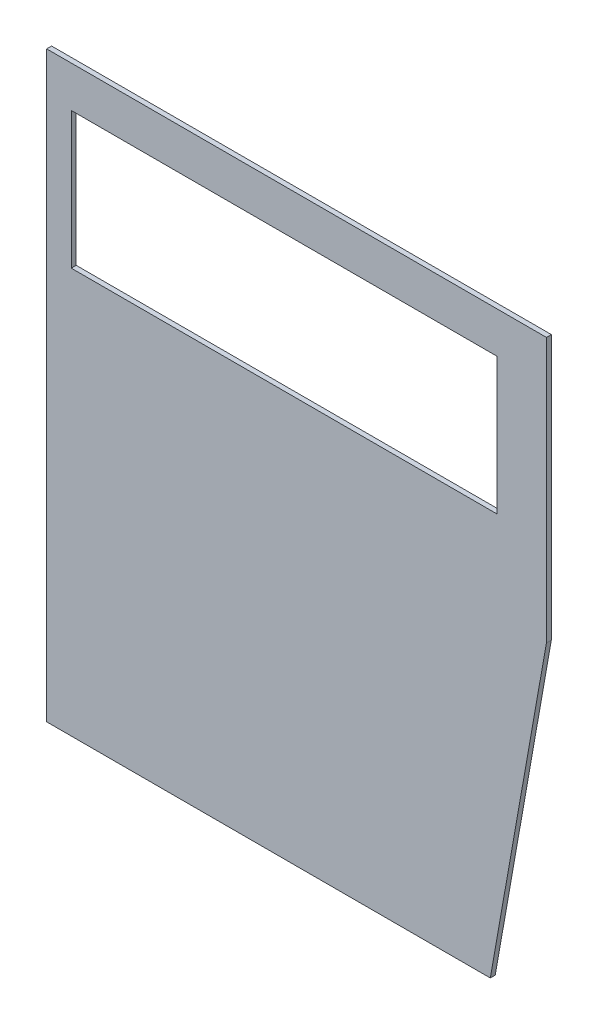
ISO-10303-21;
HEADER;
FILE_DESCRIPTION(('STEP AP214'),'2;1');
FILE_NAME('part.step','',(''),(''),'','','');
FILE_SCHEMA(('AUTOMOTIVE_DESIGN { 1 0 10303 214 1 1 1 1 }'));
ENDSEC;
DATA;
#1=APPLICATION_CONTEXT('core data for automotive mechanical design processes');
#2=APPLICATION_PROTOCOL_DEFINITION('international standard','automotive_design',2000,#1);
#3=PRODUCT_CONTEXT('',#1,'mechanical');
#4=PRODUCT('Part','Part','',(#3));
#5=PRODUCT_RELATED_PRODUCT_CATEGORY('part','',(#4));
#6=PRODUCT_DEFINITION_FORMATION('','',#4);
#7=PRODUCT_DEFINITION_CONTEXT('part definition',#1,'design');
#8=PRODUCT_DEFINITION('design','',#6,#7);
#9=PRODUCT_DEFINITION_SHAPE('','',#8);
#10=(LENGTH_UNIT() NAMED_UNIT(*) SI_UNIT(.MILLI.,.METRE.));
#11=(NAMED_UNIT(*) PLANE_ANGLE_UNIT() SI_UNIT($,.RADIAN.));
#12=(NAMED_UNIT(*) SI_UNIT($,.STERADIAN.) SOLID_ANGLE_UNIT());
#13=UNCERTAINTY_MEASURE_WITH_UNIT(LENGTH_MEASURE(1.E-05),#10,'distance_accuracy_value','');
#14=(GEOMETRIC_REPRESENTATION_CONTEXT(3) GLOBAL_UNCERTAINTY_ASSIGNED_CONTEXT((#13)) GLOBAL_UNIT_ASSIGNED_CONTEXT((#10,
#11,#12)) REPRESENTATION_CONTEXT('',''));
#15=CARTESIAN_POINT('',(0.,0.,0.));
#16=DIRECTION('',(0.,0.,1.));
#17=DIRECTION('',(1.,0.,0.));
#18=AXIS2_PLACEMENT_3D('',#15,#16,#17);
#19=CARTESIAN_POINT('',(816.176734530374,385.,-3.));
#20=DIRECTION('',(-1.,0.,0.));
#21=DIRECTION('',(0.,0.,1.));
#22=AXIS2_PLACEMENT_3D('',#19,#20,#21);
#23=PLANE('',#22);
#24=DIRECTION('',(0.,-1.,0.));
#25=VECTOR('',#24,1.);
#26=CARTESIAN_POINT('',(816.176734530374,385.,0.));
#27=LINE('',#26,#25);
#28=CARTESIAN_POINT('',(816.176734530374,385.,0.));
#29=VERTEX_POINT('',#28);
#30=CARTESIAN_POINT('',(816.176734530374,30.,0.));
#31=VERTEX_POINT('',#30);
#32=EDGE_CURVE('E138',#29,#31,#27,.T.);
#33=ORIENTED_EDGE('',*,*,#32,.F.);
#34=DIRECTION('',(0.,0.,1.));
#35=VECTOR('',#34,1.);
#36=CARTESIAN_POINT('',(816.176734530374,385.,-3.));
#37=LINE('',#36,#35);
#38=CARTESIAN_POINT('',(816.176734530374,385.,-3.));
#39=VERTEX_POINT('',#38);
#40=EDGE_CURVE('E11',#39,#29,#37,.T.);
#41=ORIENTED_EDGE('',*,*,#40,.F.);
#42=DIRECTION('',(0.,-1.,0.));
#43=VECTOR('',#42,1.);
#44=CARTESIAN_POINT('',(816.176734530374,385.,-3.));
#45=LINE('',#44,#43);
#46=CARTESIAN_POINT('',(816.176734530374,30.,-3.));
#47=VERTEX_POINT('',#46);
#48=EDGE_CURVE('E142',#39,#47,#45,.T.);
#49=ORIENTED_EDGE('',*,*,#48,.T.);
#50=DIRECTION('',(0.,0.,1.));
#51=VECTOR('',#50,1.);
#52=CARTESIAN_POINT('',(816.176734530374,30.,-3.));
#53=LINE('',#52,#51);
#54=EDGE_CURVE('E37',#47,#31,#53,.T.);
#55=ORIENTED_EDGE('',*,*,#54,.T.);
#56=EDGE_LOOP('',(#33,#41,#49,#55));
#57=FACE_BOUND('',#56,.T.);
#58=ADVANCED_FACE('F34',(#57),#23,.T.);
#59=CARTESIAN_POINT('',(1120.5748213672,385.,-3.));
#60=DIRECTION('',(0.,1.,0.));
#61=DIRECTION('',(-1.,0.,0.));
#62=AXIS2_PLACEMENT_3D('',#59,#60,#61);
#63=PLANE('',#62);
#64=DIRECTION('',(-1.,0.,0.));
#65=VECTOR('',#64,1.);
#66=CARTESIAN_POINT('',(1120.5748213672,385.,0.));
#67=LINE('',#66,#65);
#68=CARTESIAN_POINT('',(1120.5748213672,385.,0.));
#69=VERTEX_POINT('',#68);
#70=EDGE_CURVE('E146',#69,#29,#67,.T.);
#71=ORIENTED_EDGE('',*,*,#70,.F.);
#72=DIRECTION('',(0.,0.,1.));
#73=VECTOR('',#72,1.);
#74=CARTESIAN_POINT('',(1120.5748213672,385.,-3.));
#75=LINE('',#74,#73);
#76=CARTESIAN_POINT('',(1120.5748213672,385.,-3.));
#77=VERTEX_POINT('',#76);
#78=EDGE_CURVE('E42',#77,#69,#75,.T.);
#79=ORIENTED_EDGE('',*,*,#78,.F.);
#80=DIRECTION('',(-1.,0.,0.));
#81=VECTOR('',#80,1.);
#82=CARTESIAN_POINT('',(1120.5748213672,385.,-3.));
#83=LINE('',#82,#81);
#84=EDGE_CURVE('E155',#77,#39,#83,.T.);
#85=ORIENTED_EDGE('',*,*,#84,.T.);
#86=ORIENTED_EDGE('',*,*,#40,.T.);
#87=EDGE_LOOP('',(#71,#79,#85,#86));
#88=FACE_BOUND('',#87,.T.);
#89=ADVANCED_FACE('F187',(#88),#63,.T.);
#90=CARTESIAN_POINT('',(1120.5748213672,223.843941841835,-3.));
#91=DIRECTION('',(1.,0.,0.));
#92=DIRECTION('',(0.,1.,0.));
#93=AXIS2_PLACEMENT_3D('',#90,#91,#92);
#94=PLANE('',#93);
#95=DIRECTION('',(0.,1.,0.));
#96=VECTOR('',#95,1.);
#97=CARTESIAN_POINT('',(1120.5748213672,223.843941841835,0.));
#98=LINE('',#97,#96);
#99=CARTESIAN_POINT('',(1120.5748213672,223.843941841835,0.));
#100=VERTEX_POINT('',#99);
#101=EDGE_CURVE('E166',#100,#69,#98,.T.);
#102=ORIENTED_EDGE('',*,*,#101,.F.);
#103=DIRECTION('',(0.,0.,1.));
#104=VECTOR('',#103,1.);
#105=CARTESIAN_POINT('',(1120.5748213672,223.843941841835,-3.));
#106=LINE('',#105,#104);
#107=CARTESIAN_POINT('',(1120.5748213672,223.843941841835,-3.));
#108=VERTEX_POINT('',#107);
#109=EDGE_CURVE('E172',#108,#100,#106,.T.);
#110=ORIENTED_EDGE('',*,*,#109,.F.);
#111=DIRECTION('',(0.,1.,0.));
#112=VECTOR('',#111,1.);
#113=CARTESIAN_POINT('',(1120.5748213672,223.843941841835,-3.));
#114=LINE('',#113,#112);
#115=EDGE_CURVE('E152',#108,#77,#114,.T.);
#116=ORIENTED_EDGE('',*,*,#115,.T.);
#117=ORIENTED_EDGE('',*,*,#78,.T.);
#118=EDGE_LOOP('',(#102,#110,#116,#117));
#119=FACE_BOUND('',#118,.T.);
#120=ADVANCED_FACE('F194',(#119),#94,.T.);
#121=CARTESIAN_POINT('',(1086.39490437361,30.,-3.));
#122=DIRECTION('',(0.984807753012209,-0.173648177666926,0.));
#123=DIRECTION('',(0.173648177666926,0.984807753012209,0.));
#124=AXIS2_PLACEMENT_3D('',#121,#122,#123);
#125=PLANE('',#124);
#126=DIRECTION('',(0.173648177666926,0.984807753012209,0.));
#127=VECTOR('',#126,1.);
#128=CARTESIAN_POINT('',(1086.39490437361,30.,0.));
#129=LINE('',#128,#127);
#130=CARTESIAN_POINT('',(1086.39490437361,30.,0.));
#131=VERTEX_POINT('',#130);
#132=EDGE_CURVE('E163',#131,#100,#129,.T.);
#133=ORIENTED_EDGE('',*,*,#132,.F.);
#134=DIRECTION('',(0.,0.,1.));
#135=VECTOR('',#134,1.);
#136=CARTESIAN_POINT('',(1086.39490437361,30.,-3.));
#137=LINE('',#136,#135);
#138=CARTESIAN_POINT('',(1086.39490437361,30.,-3.));
#139=VERTEX_POINT('',#138);
#140=EDGE_CURVE('E173',#139,#131,#137,.T.);
#141=ORIENTED_EDGE('',*,*,#140,.F.);
#142=DIRECTION('',(0.173648177666926,0.984807753012209,0.));
#143=VECTOR('',#142,1.);
#144=CARTESIAN_POINT('',(1086.39490437361,30.,-3.));
#145=LINE('',#144,#143);
#146=EDGE_CURVE('E149',#139,#108,#145,.T.);
#147=ORIENTED_EDGE('',*,*,#146,.T.);
#148=ORIENTED_EDGE('',*,*,#109,.T.);
#149=EDGE_LOOP('',(#133,#141,#147,#148));
#150=FACE_BOUND('',#149,.T.);
#151=ADVANCED_FACE('F192',(#150),#125,.T.);
#152=CARTESIAN_POINT('',(816.176734530374,30.,-3.));
#153=DIRECTION('',(0.,-1.,0.));
#154=DIRECTION('',(0.,0.,-1.));
#155=AXIS2_PLACEMENT_3D('',#152,#153,#154);
#156=PLANE('',#155);
#157=DIRECTION('',(1.,0.,0.));
#158=VECTOR('',#157,1.);
#159=CARTESIAN_POINT('',(816.176734530374,30.,0.));
#160=LINE('',#159,#158);
#161=EDGE_CURVE('E160',#31,#131,#160,.T.);
#162=ORIENTED_EDGE('',*,*,#161,.F.);
#163=ORIENTED_EDGE('',*,*,#54,.F.);
#164=DIRECTION('',(1.,0.,0.));
#165=VECTOR('',#164,1.);
#166=CARTESIAN_POINT('',(816.176734530374,30.,-3.));
#167=LINE('',#166,#165);
#168=EDGE_CURVE('E145',#47,#139,#167,.T.);
#169=ORIENTED_EDGE('',*,*,#168,.T.);
#170=ORIENTED_EDGE('',*,*,#140,.T.);
#171=EDGE_LOOP('',(#162,#163,#169,#170));
#172=FACE_BOUND('',#171,.T.);
#173=ADVANCED_FACE('F181',(#172),#156,.T.);
#174=CARTESIAN_POINT('',(0.,0.,-3.));
#175=DIRECTION('',(0.,0.,1.));
#176=DIRECTION('',(1.,0.,0.));
#177=AXIS2_PLACEMENT_3D('',#174,#175,#176);
#178=PLANE('',#177);
#179=DIRECTION('',(-1.,0.,0.));
#180=VECTOR('',#179,1.);
#181=CARTESIAN_POINT('',(831.176734530374,360.,-3.));
#182=LINE('',#181,#180);
#183=CARTESIAN_POINT('',(1090.5748213672,360.,-3.));
#184=VERTEX_POINT('',#183);
#185=CARTESIAN_POINT('',(831.176734530374,360.,-3.));
#186=VERTEX_POINT('',#185);
#187=EDGE_CURVE('E113',#184,#186,#182,.T.);
#188=ORIENTED_EDGE('',*,*,#187,.T.);
#189=DIRECTION('',(0.,-1.,0.));
#190=VECTOR('',#189,1.);
#191=CARTESIAN_POINT('',(831.176734530374,276.809165979618,-3.));
#192=LINE('',#191,#190);
#193=CARTESIAN_POINT('',(831.176734530374,276.809165979618,-3.));
#194=VERTEX_POINT('',#193);
#195=EDGE_CURVE('E107',#186,#194,#192,.T.);
#196=ORIENTED_EDGE('',*,*,#195,.T.);
#197=DIRECTION('',(1.,0.,0.));
#198=VECTOR('',#197,1.);
#199=CARTESIAN_POINT('',(1090.5748213672,276.809165979618,-3.));
#200=LINE('',#199,#198);
#201=CARTESIAN_POINT('',(1090.5748213672,276.809165979618,-3.));
#202=VERTEX_POINT('',#201);
#203=EDGE_CURVE('E116',#194,#202,#200,.T.);
#204=ORIENTED_EDGE('',*,*,#203,.T.);
#205=DIRECTION('',(0.,1.,0.));
#206=VECTOR('',#205,1.);
#207=CARTESIAN_POINT('',(1090.5748213672,360.,-3.));
#208=LINE('',#207,#206);
#209=EDGE_CURVE('E50',#202,#184,#208,.T.);
#210=ORIENTED_EDGE('',*,*,#209,.T.);
#211=EDGE_LOOP('',(#188,#196,#204,#210));
#212=FACE_BOUND('',#211,.T.);
#213=ORIENTED_EDGE('',*,*,#48,.F.);
#214=ORIENTED_EDGE('',*,*,#84,.F.);
#215=ORIENTED_EDGE('',*,*,#115,.F.);
#216=ORIENTED_EDGE('',*,*,#146,.F.);
#217=ORIENTED_EDGE('',*,*,#168,.F.);
#218=EDGE_LOOP('',(#213,#214,#215,#216,#217));
#219=FACE_BOUND('',#218,.T.);
#220=ADVANCED_FACE('F120',(#212,#219),#178,.F.);
#221=CARTESIAN_POINT('',(0.,0.,0.));
#222=DIRECTION('',(0.,0.,1.));
#223=DIRECTION('',(1.,0.,0.));
#224=AXIS2_PLACEMENT_3D('',#221,#222,#223);
#225=PLANE('',#224);
#226=DIRECTION('',(0.,-1.,0.));
#227=VECTOR('',#226,1.);
#228=CARTESIAN_POINT('',(831.176734530374,276.809165979618,0.));
#229=LINE('',#228,#227);
#230=CARTESIAN_POINT('',(831.176734530374,360.,0.));
#231=VERTEX_POINT('',#230);
#232=CARTESIAN_POINT('',(831.176734530374,276.809165979618,0.));
#233=VERTEX_POINT('',#232);
#234=EDGE_CURVE('E58',#231,#233,#229,.T.);
#235=ORIENTED_EDGE('',*,*,#234,.F.);
#236=DIRECTION('',(-1.,0.,0.));
#237=VECTOR('',#236,1.);
#238=CARTESIAN_POINT('',(831.176734530374,360.,0.));
#239=LINE('',#238,#237);
#240=CARTESIAN_POINT('',(1090.5748213672,360.,0.));
#241=VERTEX_POINT('',#240);
#242=EDGE_CURVE('E123',#241,#231,#239,.T.);
#243=ORIENTED_EDGE('',*,*,#242,.F.);
#244=DIRECTION('',(0.,1.,0.));
#245=VECTOR('',#244,1.);
#246=CARTESIAN_POINT('',(1090.5748213672,360.,0.));
#247=LINE('',#246,#245);
#248=CARTESIAN_POINT('',(1090.5748213672,276.809165979618,0.));
#249=VERTEX_POINT('',#248);
#250=EDGE_CURVE('E126',#249,#241,#247,.T.);
#251=ORIENTED_EDGE('',*,*,#250,.F.);
#252=DIRECTION('',(1.,0.,0.));
#253=VECTOR('',#252,1.);
#254=CARTESIAN_POINT('',(1090.5748213672,276.809165979618,0.));
#255=LINE('',#254,#253);
#256=EDGE_CURVE('E132',#233,#249,#255,.T.);
#257=ORIENTED_EDGE('',*,*,#256,.F.);
#258=EDGE_LOOP('',(#235,#243,#251,#257));
#259=FACE_BOUND('',#258,.T.);
#260=ORIENTED_EDGE('',*,*,#32,.T.);
#261=ORIENTED_EDGE('',*,*,#161,.T.);
#262=ORIENTED_EDGE('',*,*,#132,.T.);
#263=ORIENTED_EDGE('',*,*,#101,.T.);
#264=ORIENTED_EDGE('',*,*,#70,.T.);
#265=EDGE_LOOP('',(#260,#261,#262,#263,#264));
#266=FACE_BOUND('',#265,.T.);
#267=ADVANCED_FACE('F183',(#259,#266),#225,.T.);
#268=CARTESIAN_POINT('',(831.176734530374,276.809165979618,-3.));
#269=DIRECTION('',(-1.,0.,0.));
#270=DIRECTION('',(0.,0.,1.));
#271=AXIS2_PLACEMENT_3D('',#268,#269,#270);
#272=PLANE('',#271);
#273=ORIENTED_EDGE('',*,*,#234,.T.);
#274=DIRECTION('',(0.,0.,1.));
#275=VECTOR('',#274,1.);
#276=CARTESIAN_POINT('',(831.176734530374,276.809165979618,-3.));
#277=LINE('',#276,#275);
#278=EDGE_CURVE('E103',#194,#233,#277,.T.);
#279=ORIENTED_EDGE('',*,*,#278,.F.);
#280=ORIENTED_EDGE('',*,*,#195,.F.);
#281=DIRECTION('',(0.,0.,1.));
#282=VECTOR('',#281,1.);
#283=CARTESIAN_POINT('',(831.176734530374,360.,-3.));
#284=LINE('',#283,#282);
#285=EDGE_CURVE('E136',#186,#231,#284,.T.);
#286=ORIENTED_EDGE('',*,*,#285,.T.);
#287=EDGE_LOOP('',(#273,#279,#280,#286));
#288=FACE_BOUND('',#287,.T.);
#289=ADVANCED_FACE('F105',(#288),#272,.F.);
#290=CARTESIAN_POINT('',(831.176734530374,360.,-3.));
#291=DIRECTION('',(0.,1.,0.));
#292=DIRECTION('',(0.,0.,1.));
#293=AXIS2_PLACEMENT_3D('',#290,#291,#292);
#294=PLANE('',#293);
#295=ORIENTED_EDGE('',*,*,#242,.T.);
#296=ORIENTED_EDGE('',*,*,#285,.F.);
#297=ORIENTED_EDGE('',*,*,#187,.F.);
#298=DIRECTION('',(0.,0.,1.));
#299=VECTOR('',#298,1.);
#300=CARTESIAN_POINT('',(1090.5748213672,360.,-3.));
#301=LINE('',#300,#299);
#302=EDGE_CURVE('E139',#184,#241,#301,.T.);
#303=ORIENTED_EDGE('',*,*,#302,.T.);
#304=EDGE_LOOP('',(#295,#296,#297,#303));
#305=FACE_BOUND('',#304,.T.);
#306=ADVANCED_FACE('F253',(#305),#294,.F.);
#307=CARTESIAN_POINT('',(1090.5748213672,360.,-3.));
#308=DIRECTION('',(1.,0.,0.));
#309=DIRECTION('',(0.,0.,-1.));
#310=AXIS2_PLACEMENT_3D('',#307,#308,#309);
#311=PLANE('',#310);
#312=ORIENTED_EDGE('',*,*,#250,.T.);
#313=ORIENTED_EDGE('',*,*,#302,.F.);
#314=ORIENTED_EDGE('',*,*,#209,.F.);
#315=DIRECTION('',(0.,0.,1.));
#316=VECTOR('',#315,1.);
#317=CARTESIAN_POINT('',(1090.5748213672,276.809165979618,-3.));
#318=LINE('',#317,#316);
#319=EDGE_CURVE('E112',#202,#249,#318,.T.);
#320=ORIENTED_EDGE('',*,*,#319,.T.);
#321=EDGE_LOOP('',(#312,#313,#314,#320));
#322=FACE_BOUND('',#321,.T.);
#323=ADVANCED_FACE('F262',(#322),#311,.F.);
#324=CARTESIAN_POINT('',(1090.5748213672,276.809165979618,-3.));
#325=DIRECTION('',(0.,-1.,0.));
#326=DIRECTION('',(0.,0.,-1.));
#327=AXIS2_PLACEMENT_3D('',#324,#325,#326);
#328=PLANE('',#327);
#329=ORIENTED_EDGE('',*,*,#256,.T.);
#330=ORIENTED_EDGE('',*,*,#319,.F.);
#331=ORIENTED_EDGE('',*,*,#203,.F.);
#332=ORIENTED_EDGE('',*,*,#278,.T.);
#333=EDGE_LOOP('',(#329,#330,#331,#332));
#334=FACE_BOUND('',#333,.T.);
#335=ADVANCED_FACE('F117',(#334),#328,.F.);
#336=CLOSED_SHELL('',(#58,#89,#120,#151,#173,#220,#267,#289,#306,#323,#335));
#337=MANIFOLD_SOLID_BREP('B2',#336);
#338=ADVANCED_BREP_SHAPE_REPRESENTATION('',(#18,#337),#14);
#339=SHAPE_DEFINITION_REPRESENTATION(#9,#338);
ENDSEC;
END-ISO-10303-21;
